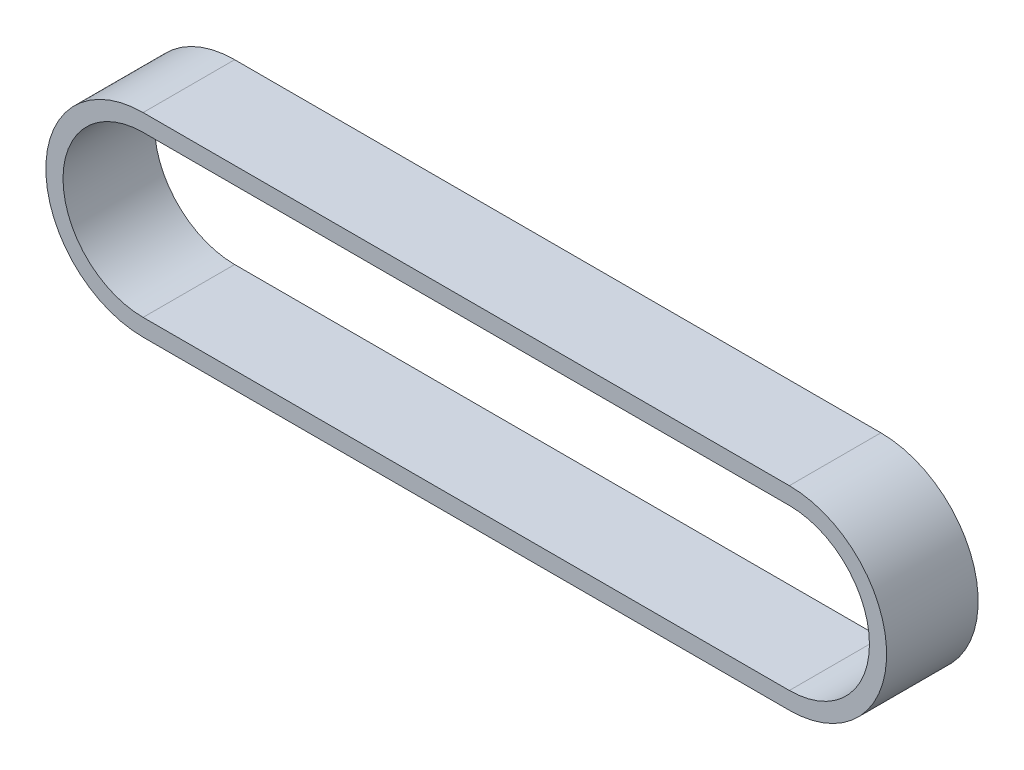
ISO-10303-21;
HEADER;
FILE_DESCRIPTION(('STEP AP214'),'2;1');
FILE_NAME('part.step','',(''),(''),'','','');
FILE_SCHEMA(('AUTOMOTIVE_DESIGN { 1 0 10303 214 1 1 1 1 }'));
ENDSEC;
DATA;
#1=APPLICATION_CONTEXT('core data for automotive mechanical design processes');
#2=APPLICATION_PROTOCOL_DEFINITION('international standard','automotive_design',2000,#1);
#3=PRODUCT_CONTEXT('',#1,'mechanical');
#4=PRODUCT('Part','Part','',(#3));
#5=PRODUCT_RELATED_PRODUCT_CATEGORY('part','',(#4));
#6=PRODUCT_DEFINITION_FORMATION('','',#4);
#7=PRODUCT_DEFINITION_CONTEXT('part definition',#1,'design');
#8=PRODUCT_DEFINITION('design','',#6,#7);
#9=PRODUCT_DEFINITION_SHAPE('','',#8);
#10=(LENGTH_UNIT() NAMED_UNIT(*) SI_UNIT(.MILLI.,.METRE.));
#11=(NAMED_UNIT(*) PLANE_ANGLE_UNIT() SI_UNIT($,.RADIAN.));
#12=(NAMED_UNIT(*) SI_UNIT($,.STERADIAN.) SOLID_ANGLE_UNIT());
#13=UNCERTAINTY_MEASURE_WITH_UNIT(LENGTH_MEASURE(1.E-05),#10,'distance_accuracy_value','');
#14=(GEOMETRIC_REPRESENTATION_CONTEXT(3) GLOBAL_UNCERTAINTY_ASSIGNED_CONTEXT((#13)) GLOBAL_UNIT_ASSIGNED_CONTEXT((#10,
#11,#12)) REPRESENTATION_CONTEXT('',''));
#15=CARTESIAN_POINT('',(0.,0.,0.));
#16=DIRECTION('',(0.,0.,1.));
#17=DIRECTION('',(1.,0.,0.));
#18=AXIS2_PLACEMENT_3D('',#15,#16,#17);
#19=CARTESIAN_POINT('',(0.,6.8,6.4));
#20=DIRECTION('',(0.,-1.,0.));
#21=DIRECTION('',(1.,0.,0.));
#22=AXIS2_PLACEMENT_3D('',#19,#20,#21);
#23=PLANE('',#22);
#24=DIRECTION('',(-1.,0.,0.));
#25=VECTOR('',#24,1.);
#26=CARTESIAN_POINT('',(0.,6.8,0.));
#27=LINE('',#26,#25);
#28=CARTESIAN_POINT('',(0.,6.8,0.));
#29=VERTEX_POINT('',#28);
#30=CARTESIAN_POINT('',(-45.1774279922987,6.80000000000015,0.));
#31=VERTEX_POINT('',#30);
#32=EDGE_CURVE('E140',#29,#31,#27,.T.);
#33=ORIENTED_EDGE('',*,*,#32,.T.);
#34=DIRECTION('',(0.,0.,-1.));
#35=VECTOR('',#34,1.);
#36=CARTESIAN_POINT('',(-45.1774279922987,6.80000000000015,6.4));
#37=LINE('',#36,#35);
#38=CARTESIAN_POINT('',(-45.1774279922987,6.80000000000015,6.4));
#39=VERTEX_POINT('',#38);
#40=EDGE_CURVE('E11',#39,#31,#37,.T.);
#41=ORIENTED_EDGE('',*,*,#40,.F.);
#42=DIRECTION('',(-1.,0.,0.));
#43=VECTOR('',#42,1.);
#44=CARTESIAN_POINT('',(0.,6.8,6.4));
#45=LINE('',#44,#43);
#46=CARTESIAN_POINT('',(0.,6.8,6.4));
#47=VERTEX_POINT('',#46);
#48=EDGE_CURVE('E111',#47,#39,#45,.T.);
#49=ORIENTED_EDGE('',*,*,#48,.F.);
#50=DIRECTION('',(0.,0.,-1.));
#51=VECTOR('',#50,1.);
#52=CARTESIAN_POINT('',(0.,6.8,6.4));
#53=LINE('',#52,#51);
#54=EDGE_CURVE('E148',#47,#29,#53,.T.);
#55=ORIENTED_EDGE('',*,*,#54,.T.);
#56=EDGE_LOOP('',(#33,#41,#49,#55));
#57=FACE_BOUND('',#56,.T.);
#58=ADVANCED_FACE('F34',(#57),#23,.F.);
#59=CARTESIAN_POINT('',(-45.1774279922987,-1.58944038486375E-13,6.4));
#60=DIRECTION('',(0.,0.,-1.));
#61=DIRECTION('',(-1.,0.,0.));
#62=AXIS2_PLACEMENT_3D('',#59,#60,#61);
#63=CYLINDRICAL_SURFACE('',#62,6.80000000000015);
#64=CARTESIAN_POINT('',(-45.1774279922987,-1.58944038486375E-13,0.));
#65=DIRECTION('',(0.,0.,1.));
#66=DIRECTION('',(1.,0.,0.));
#67=AXIS2_PLACEMENT_3D('',#64,#65,#66);
#68=CIRCLE('',#67,6.80000000000015);
#69=CARTESIAN_POINT('',(-45.1774279922987,-6.80000000000016,0.));
#70=VERTEX_POINT('',#69);
#71=EDGE_CURVE('E117',#31,#70,#68,.T.);
#72=ORIENTED_EDGE('',*,*,#71,.T.);
#73=DIRECTION('',(0.,0.,-1.));
#74=VECTOR('',#73,1.);
#75=CARTESIAN_POINT('',(-45.1774279922987,-6.80000000000016,6.4));
#76=LINE('',#75,#74);
#77=CARTESIAN_POINT('',(-45.1774279922987,-6.80000000000016,6.4));
#78=VERTEX_POINT('',#77);
#79=EDGE_CURVE('E44',#78,#70,#76,.T.);
#80=ORIENTED_EDGE('',*,*,#79,.F.);
#81=CARTESIAN_POINT('',(-45.1774279922987,-1.58944038486375E-13,6.4));
#82=DIRECTION('',(0.,0.,1.));
#83=DIRECTION('',(1.,0.,0.));
#84=AXIS2_PLACEMENT_3D('',#81,#82,#83);
#85=CIRCLE('',#84,6.80000000000015);
#86=EDGE_CURVE('E105',#39,#78,#85,.T.);
#87=ORIENTED_EDGE('',*,*,#86,.F.);
#88=ORIENTED_EDGE('',*,*,#40,.T.);
#89=EDGE_LOOP('',(#72,#80,#87,#88));
#90=FACE_BOUND('',#89,.T.);
#91=ADVANCED_FACE('F116',(#90),#63,.T.);
#92=CARTESIAN_POINT('',(0.,-6.8,6.4));
#93=DIRECTION('',(0.,-1.,0.));
#94=DIRECTION('',(1.,0.,0.));
#95=AXIS2_PLACEMENT_3D('',#92,#93,#94);
#96=PLANE('',#95);
#97=DIRECTION('',(-1.,0.,0.));
#98=VECTOR('',#97,1.);
#99=CARTESIAN_POINT('',(0.,-6.8,0.));
#100=LINE('',#99,#98);
#101=CARTESIAN_POINT('',(0.,-6.8,0.));
#102=VERTEX_POINT('',#101);
#103=EDGE_CURVE('E144',#102,#70,#100,.T.);
#104=ORIENTED_EDGE('',*,*,#103,.F.);
#105=DIRECTION('',(0.,0.,-1.));
#106=VECTOR('',#105,1.);
#107=CARTESIAN_POINT('',(0.,-6.8,6.4));
#108=LINE('',#107,#106);
#109=CARTESIAN_POINT('',(0.,-6.8,6.4));
#110=VERTEX_POINT('',#109);
#111=EDGE_CURVE('E81',#110,#102,#108,.T.);
#112=ORIENTED_EDGE('',*,*,#111,.F.);
#113=DIRECTION('',(-1.,0.,0.));
#114=VECTOR('',#113,1.);
#115=CARTESIAN_POINT('',(0.,-6.8,6.4));
#116=LINE('',#115,#114);
#117=EDGE_CURVE('E109',#110,#78,#116,.T.);
#118=ORIENTED_EDGE('',*,*,#117,.T.);
#119=ORIENTED_EDGE('',*,*,#79,.T.);
#120=EDGE_LOOP('',(#104,#112,#118,#119));
#121=FACE_BOUND('',#120,.T.);
#122=ADVANCED_FACE('F122',(#121),#96,.T.);
#123=CARTESIAN_POINT('',(-45.1774279922987,-1.58944038486375E-13,6.4));
#124=DIRECTION('',(0.,0.,-1.));
#125=DIRECTION('',(-1.,0.,0.));
#126=AXIS2_PLACEMENT_3D('',#123,#124,#125);
#127=CYLINDRICAL_SURFACE('',#126,5.60000000000016);
#128=CARTESIAN_POINT('',(-45.1774279922987,-1.58944038486375E-13,0.));
#129=DIRECTION('',(0.,0.,1.));
#130=DIRECTION('',(1.,0.,0.));
#131=AXIS2_PLACEMENT_3D('',#128,#129,#130);
#132=CIRCLE('',#131,5.60000000000016);
#133=CARTESIAN_POINT('',(-45.1774279922987,5.60000000000015,0.));
#134=VERTEX_POINT('',#133);
#135=CARTESIAN_POINT('',(-45.1774279922987,-5.60000000000016,0.));
#136=VERTEX_POINT('',#135);
#137=EDGE_CURVE('E128',#134,#136,#132,.T.);
#138=ORIENTED_EDGE('',*,*,#137,.F.);
#139=DIRECTION('',(0.,0.,-1.));
#140=VECTOR('',#139,1.);
#141=CARTESIAN_POINT('',(-45.1774279922987,5.60000000000015,6.4));
#142=LINE('',#141,#140);
#143=CARTESIAN_POINT('',(-45.1774279922987,5.60000000000015,6.4));
#144=VERTEX_POINT('',#143);
#145=EDGE_CURVE('E38',#144,#134,#142,.T.);
#146=ORIENTED_EDGE('',*,*,#145,.F.);
#147=CARTESIAN_POINT('',(-45.1774279922987,-1.58944038486375E-13,6.4));
#148=DIRECTION('',(0.,0.,1.));
#149=DIRECTION('',(1.,0.,0.));
#150=AXIS2_PLACEMENT_3D('',#147,#148,#149);
#151=CIRCLE('',#150,5.60000000000016);
#152=CARTESIAN_POINT('',(-45.1774279922987,-5.60000000000016,6.4));
#153=VERTEX_POINT('',#152);
#154=EDGE_CURVE('E147',#144,#153,#151,.T.);
#155=ORIENTED_EDGE('',*,*,#154,.T.);
#156=DIRECTION('',(0.,0.,-1.));
#157=VECTOR('',#156,1.);
#158=CARTESIAN_POINT('',(-45.1774279922987,-5.60000000000016,6.4));
#159=LINE('',#158,#157);
#160=EDGE_CURVE('E124',#153,#136,#159,.T.);
#161=ORIENTED_EDGE('',*,*,#160,.T.);
#162=EDGE_LOOP('',(#138,#146,#155,#161));
#163=FACE_BOUND('',#162,.T.);
#164=ADVANCED_FACE('F36',(#163),#127,.F.);
#165=CARTESIAN_POINT('',(0.,5.6,6.4));
#166=DIRECTION('',(0.,-1.,0.));
#167=DIRECTION('',(1.,0.,0.));
#168=AXIS2_PLACEMENT_3D('',#165,#166,#167);
#169=PLANE('',#168);
#170=DIRECTION('',(-1.,0.,0.));
#171=VECTOR('',#170,1.);
#172=CARTESIAN_POINT('',(0.,5.6,0.));
#173=LINE('',#172,#171);
#174=CARTESIAN_POINT('',(0.,5.6,0.));
#175=VERTEX_POINT('',#174);
#176=EDGE_CURVE('E131',#175,#134,#173,.T.);
#177=ORIENTED_EDGE('',*,*,#176,.F.);
#178=DIRECTION('',(0.,0.,-1.));
#179=VECTOR('',#178,1.);
#180=CARTESIAN_POINT('',(0.,5.6,6.4));
#181=LINE('',#180,#179);
#182=CARTESIAN_POINT('',(0.,5.6,6.4));
#183=VERTEX_POINT('',#182);
#184=EDGE_CURVE('E153',#183,#175,#181,.T.);
#185=ORIENTED_EDGE('',*,*,#184,.F.);
#186=DIRECTION('',(-1.,0.,0.));
#187=VECTOR('',#186,1.);
#188=CARTESIAN_POINT('',(0.,5.6,6.4));
#189=LINE('',#188,#187);
#190=EDGE_CURVE('E162',#183,#144,#189,.T.);
#191=ORIENTED_EDGE('',*,*,#190,.T.);
#192=ORIENTED_EDGE('',*,*,#145,.T.);
#193=EDGE_LOOP('',(#177,#185,#191,#192));
#194=FACE_BOUND('',#193,.T.);
#195=ADVANCED_FACE('F160',(#194),#169,.T.);
#196=CARTESIAN_POINT('',(0.,0.,6.4));
#197=DIRECTION('',(0.,0.,-1.));
#198=DIRECTION('',(-1.,0.,0.));
#199=AXIS2_PLACEMENT_3D('',#196,#197,#198);
#200=CYLINDRICAL_SURFACE('',#199,5.6);
#201=CARTESIAN_POINT('',(0.,0.,0.));
#202=DIRECTION('',(0.,0.,1.));
#203=DIRECTION('',(1.,0.,0.));
#204=AXIS2_PLACEMENT_3D('',#201,#202,#203);
#205=CIRCLE('',#204,5.6);
#206=CARTESIAN_POINT('',(0.,-5.6,0.));
#207=VERTEX_POINT('',#206);
#208=EDGE_CURVE('E134',#207,#175,#205,.T.);
#209=ORIENTED_EDGE('',*,*,#208,.F.);
#210=DIRECTION('',(0.,0.,-1.));
#211=VECTOR('',#210,1.);
#212=CARTESIAN_POINT('',(0.,-5.6,6.4));
#213=LINE('',#212,#211);
#214=CARTESIAN_POINT('',(0.,-5.6,6.4));
#215=VERTEX_POINT('',#214);
#216=EDGE_CURVE('E152',#215,#207,#213,.T.);
#217=ORIENTED_EDGE('',*,*,#216,.F.);
#218=CARTESIAN_POINT('',(0.,0.,6.4));
#219=DIRECTION('',(0.,0.,1.));
#220=DIRECTION('',(1.,0.,0.));
#221=AXIS2_PLACEMENT_3D('',#218,#219,#220);
#222=CIRCLE('',#221,5.6);
#223=EDGE_CURVE('E171',#215,#183,#222,.T.);
#224=ORIENTED_EDGE('',*,*,#223,.T.);
#225=ORIENTED_EDGE('',*,*,#184,.T.);
#226=EDGE_LOOP('',(#209,#217,#224,#225));
#227=FACE_BOUND('',#226,.T.);
#228=ADVANCED_FACE('F168',(#227),#200,.F.);
#229=CARTESIAN_POINT('',(0.,-5.6,6.4));
#230=DIRECTION('',(0.,-1.,0.));
#231=DIRECTION('',(1.,0.,0.));
#232=AXIS2_PLACEMENT_3D('',#229,#230,#231);
#233=PLANE('',#232);
#234=DIRECTION('',(-1.,0.,0.));
#235=VECTOR('',#234,1.);
#236=CARTESIAN_POINT('',(0.,-5.6,0.));
#237=LINE('',#236,#235);
#238=EDGE_CURVE('E137',#207,#136,#237,.T.);
#239=ORIENTED_EDGE('',*,*,#238,.T.);
#240=ORIENTED_EDGE('',*,*,#160,.F.);
#241=DIRECTION('',(-1.,0.,0.));
#242=VECTOR('',#241,1.);
#243=CARTESIAN_POINT('',(0.,-5.6,6.4));
#244=LINE('',#243,#242);
#245=EDGE_CURVE('E173',#215,#153,#244,.T.);
#246=ORIENTED_EDGE('',*,*,#245,.F.);
#247=ORIENTED_EDGE('',*,*,#216,.T.);
#248=EDGE_LOOP('',(#239,#240,#246,#247));
#249=FACE_BOUND('',#248,.T.);
#250=ADVANCED_FACE('F174',(#249),#233,.F.);
#251=CARTESIAN_POINT('',(0.,0.,6.4));
#252=DIRECTION('',(0.,0.,-1.));
#253=DIRECTION('',(-1.,0.,0.));
#254=AXIS2_PLACEMENT_3D('',#251,#252,#253);
#255=CYLINDRICAL_SURFACE('',#254,6.8);
#256=CARTESIAN_POINT('',(0.,0.,0.));
#257=DIRECTION('',(0.,0.,1.));
#258=DIRECTION('',(1.,0.,0.));
#259=AXIS2_PLACEMENT_3D('',#256,#257,#258);
#260=CIRCLE('',#259,6.8);
#261=EDGE_CURVE('E84',#102,#29,#260,.T.);
#262=ORIENTED_EDGE('',*,*,#261,.T.);
#263=ORIENTED_EDGE('',*,*,#54,.F.);
#264=CARTESIAN_POINT('',(0.,0.,6.4));
#265=DIRECTION('',(0.,0.,1.));
#266=DIRECTION('',(1.,0.,0.));
#267=AXIS2_PLACEMENT_3D('',#264,#265,#266);
#268=CIRCLE('',#267,6.8);
#269=EDGE_CURVE('E53',#110,#47,#268,.T.);
#270=ORIENTED_EDGE('',*,*,#269,.F.);
#271=ORIENTED_EDGE('',*,*,#111,.T.);
#272=EDGE_LOOP('',(#262,#263,#270,#271));
#273=FACE_BOUND('',#272,.T.);
#274=ADVANCED_FACE('F181',(#273),#255,.T.);
#275=CARTESIAN_POINT('',(0.,0.,6.4));
#276=DIRECTION('',(0.,0.,1.));
#277=DIRECTION('',(1.,0.,0.));
#278=AXIS2_PLACEMENT_3D('',#275,#276,#277);
#279=PLANE('',#278);
#280=ORIENTED_EDGE('',*,*,#154,.F.);
#281=ORIENTED_EDGE('',*,*,#190,.F.);
#282=ORIENTED_EDGE('',*,*,#223,.F.);
#283=ORIENTED_EDGE('',*,*,#245,.T.);
#284=EDGE_LOOP('',(#280,#281,#282,#283));
#285=FACE_BOUND('',#284,.T.);
#286=ORIENTED_EDGE('',*,*,#48,.T.);
#287=ORIENTED_EDGE('',*,*,#86,.T.);
#288=ORIENTED_EDGE('',*,*,#117,.F.);
#289=ORIENTED_EDGE('',*,*,#269,.T.);
#290=EDGE_LOOP('',(#286,#287,#288,#289));
#291=FACE_BOUND('',#290,.T.);
#292=ADVANCED_FACE('F107',(#285,#291),#279,.T.);
#293=CARTESIAN_POINT('',(0.,0.,0.));
#294=DIRECTION('',(0.,0.,1.));
#295=DIRECTION('',(1.,0.,0.));
#296=AXIS2_PLACEMENT_3D('',#293,#294,#295);
#297=PLANE('',#296);
#298=ORIENTED_EDGE('',*,*,#137,.T.);
#299=ORIENTED_EDGE('',*,*,#238,.F.);
#300=ORIENTED_EDGE('',*,*,#208,.T.);
#301=ORIENTED_EDGE('',*,*,#176,.T.);
#302=EDGE_LOOP('',(#298,#299,#300,#301));
#303=FACE_BOUND('',#302,.T.);
#304=ORIENTED_EDGE('',*,*,#32,.F.);
#305=ORIENTED_EDGE('',*,*,#261,.F.);
#306=ORIENTED_EDGE('',*,*,#103,.T.);
#307=ORIENTED_EDGE('',*,*,#71,.F.);
#308=EDGE_LOOP('',(#304,#305,#306,#307));
#309=FACE_BOUND('',#308,.T.);
#310=ADVANCED_FACE('F166',(#303,#309),#297,.F.);
#311=CLOSED_SHELL('',(#58,#91,#122,#164,#195,#228,#250,#274,#292,#310));
#312=MANIFOLD_SOLID_BREP('B2',#311);
#313=ADVANCED_BREP_SHAPE_REPRESENTATION('',(#18,#312),#14);
#314=SHAPE_DEFINITION_REPRESENTATION(#9,#313);
ENDSEC;
END-ISO-10303-21;
